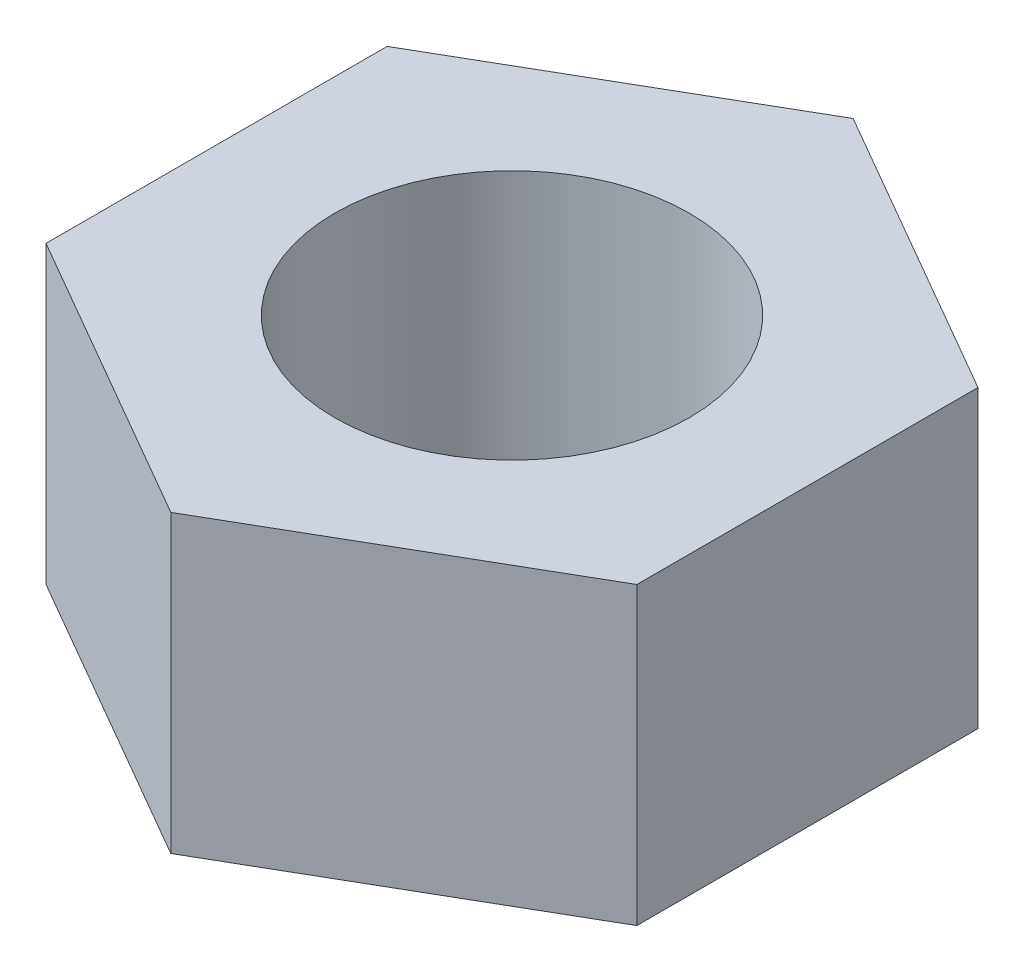
ISO-10303-21;
HEADER;
FILE_DESCRIPTION(('STEP AP214'),'2;1');
FILE_NAME('part.step','',(''),(''),'','','');
FILE_SCHEMA(('AUTOMOTIVE_DESIGN { 1 0 10303 214 1 1 1 1 }'));
ENDSEC;
DATA;
#1=APPLICATION_CONTEXT('core data for automotive mechanical design processes');
#2=APPLICATION_PROTOCOL_DEFINITION('international standard','automotive_design',2000,#1);
#3=PRODUCT_CONTEXT('',#1,'mechanical');
#4=PRODUCT('Part','Part','',(#3));
#5=PRODUCT_RELATED_PRODUCT_CATEGORY('part','',(#4));
#6=PRODUCT_DEFINITION_FORMATION('','',#4);
#7=PRODUCT_DEFINITION_CONTEXT('part definition',#1,'design');
#8=PRODUCT_DEFINITION('design','',#6,#7);
#9=PRODUCT_DEFINITION_SHAPE('','',#8);
#10=(LENGTH_UNIT() NAMED_UNIT(*) SI_UNIT(.MILLI.,.METRE.));
#11=(NAMED_UNIT(*) PLANE_ANGLE_UNIT() SI_UNIT($,.RADIAN.));
#12=(NAMED_UNIT(*) SI_UNIT($,.STERADIAN.) SOLID_ANGLE_UNIT());
#13=UNCERTAINTY_MEASURE_WITH_UNIT(LENGTH_MEASURE(1.E-05),#10,'distance_accuracy_value','');
#14=(GEOMETRIC_REPRESENTATION_CONTEXT(3) GLOBAL_UNCERTAINTY_ASSIGNED_CONTEXT((#13)) GLOBAL_UNIT_ASSIGNED_CONTEXT((#10,
#11,#12)) REPRESENTATION_CONTEXT('',''));
#15=CARTESIAN_POINT('',(0.,0.,0.));
#16=DIRECTION('',(0.,0.,1.));
#17=DIRECTION('',(1.,0.,0.));
#18=AXIS2_PLACEMENT_3D('',#15,#16,#17);
#19=CARTESIAN_POINT('',(0.,5.,0.));
#20=DIRECTION('',(0.,-1.,0.));
#21=DIRECTION('',(0.,0.,-1.));
#22=AXIS2_PLACEMENT_3D('',#19,#20,#21);
#23=PLANE('',#22);
#24=DIRECTION('',(0.866025403784438,0.,-0.500000000000001));
#25=VECTOR('',#24,1.);
#26=CARTESIAN_POINT('',(0.,5.,5.77350269189626));
#27=LINE('',#26,#25);
#28=CARTESIAN_POINT('',(0.,5.,5.77350269189626));
#29=VERTEX_POINT('',#28);
#30=CARTESIAN_POINT('',(5.,5.,2.88675134594812));
#31=VERTEX_POINT('',#30);
#32=EDGE_CURVE('E129',#29,#31,#27,.T.);
#33=ORIENTED_EDGE('',*,*,#32,.T.);
#34=DIRECTION('',(0.,0.,-1.));
#35=VECTOR('',#34,1.);
#36=CARTESIAN_POINT('',(5.,5.,-2.88675134594814));
#37=LINE('',#36,#35);
#38=CARTESIAN_POINT('',(5.,5.,-2.88675134594814));
#39=VERTEX_POINT('',#38);
#40=EDGE_CURVE('E87',#31,#39,#37,.T.);
#41=ORIENTED_EDGE('',*,*,#40,.T.);
#42=DIRECTION('',(-0.866025403784438,0.,-0.500000000000001));
#43=VECTOR('',#42,1.);
#44=CARTESIAN_POINT('',(0.,5.,-5.77350269189627));
#45=LINE('',#44,#43);
#46=CARTESIAN_POINT('',(0.,5.,-5.77350269189627));
#47=VERTEX_POINT('',#46);
#48=EDGE_CURVE('E100',#39,#47,#45,.T.);
#49=ORIENTED_EDGE('',*,*,#48,.T.);
#50=DIRECTION('',(-0.866025403784438,0.,0.5));
#51=VECTOR('',#50,1.);
#52=CARTESIAN_POINT('',(-4.99999999999999,5.,-2.88675134594814));
#53=LINE('',#52,#51);
#54=CARTESIAN_POINT('',(-4.99999999999999,5.,-2.88675134594814));
#55=VERTEX_POINT('',#54);
#56=EDGE_CURVE('E94',#47,#55,#53,.T.);
#57=ORIENTED_EDGE('',*,*,#56,.T.);
#58=DIRECTION('',(0.,0.,1.));
#59=VECTOR('',#58,1.);
#60=CARTESIAN_POINT('',(-4.99999999999999,5.,-2.88675134594814));
#61=LINE('',#60,#59);
#62=CARTESIAN_POINT('',(-5.,5.,2.88675134594812));
#63=VERTEX_POINT('',#62);
#64=EDGE_CURVE('E98',#55,#63,#61,.T.);
#65=ORIENTED_EDGE('',*,*,#64,.T.);
#66=DIRECTION('',(0.866025403784438,0.,0.500000000000001));
#67=VECTOR('',#66,1.);
#68=CARTESIAN_POINT('',(-5.,5.,2.88675134594812));
#69=LINE('',#68,#67);
#70=EDGE_CURVE('E50',#63,#29,#69,.T.);
#71=ORIENTED_EDGE('',*,*,#70,.T.);
#72=EDGE_LOOP('',(#33,#41,#49,#57,#65,#71));
#73=FACE_BOUND('',#72,.T.);
#74=CARTESIAN_POINT('',(0.,5.,0.));
#75=DIRECTION('',(0.,1.,0.));
#76=DIRECTION('',(0.,0.,1.));
#77=AXIS2_PLACEMENT_3D('',#74,#75,#76);
#78=CIRCLE('',#77,3.);
#79=CARTESIAN_POINT('',(0.,5.,3.));
#80=VERTEX_POINT('',#79);
#81=EDGE_CURVE('E122',#80,#80,#78,.T.);
#82=ORIENTED_EDGE('',*,*,#81,.F.);
#83=EDGE_LOOP('',(#82));
#84=FACE_BOUND('',#83,.T.);
#85=ADVANCED_FACE('F33',(#73,#84),#23,.F.);
#86=CARTESIAN_POINT('',(0.,0.,0.));
#87=DIRECTION('',(0.,-1.,0.));
#88=DIRECTION('',(0.,0.,-1.));
#89=AXIS2_PLACEMENT_3D('',#86,#87,#88);
#90=PLANE('',#89);
#91=DIRECTION('',(0.866025403784438,0.,-0.500000000000001));
#92=VECTOR('',#91,1.);
#93=CARTESIAN_POINT('',(0.,0.,5.77350269189626));
#94=LINE('',#93,#92);
#95=CARTESIAN_POINT('',(0.,0.,5.77350269189626));
#96=VERTEX_POINT('',#95);
#97=CARTESIAN_POINT('',(5.,0.,2.88675134594812));
#98=VERTEX_POINT('',#97);
#99=EDGE_CURVE('E118',#96,#98,#94,.T.);
#100=ORIENTED_EDGE('',*,*,#99,.F.);
#101=DIRECTION('',(0.866025403784438,0.,0.500000000000001));
#102=VECTOR('',#101,1.);
#103=CARTESIAN_POINT('',(-5.,0.,2.88675134594812));
#104=LINE('',#103,#102);
#105=CARTESIAN_POINT('',(-5.,0.,2.88675134594812));
#106=VERTEX_POINT('',#105);
#107=EDGE_CURVE('E79',#106,#96,#104,.T.);
#108=ORIENTED_EDGE('',*,*,#107,.F.);
#109=DIRECTION('',(0.,0.,1.));
#110=VECTOR('',#109,1.);
#111=CARTESIAN_POINT('',(-4.99999999999999,0.,-2.88675134594814));
#112=LINE('',#111,#110);
#113=CARTESIAN_POINT('',(-4.99999999999999,0.,-2.88675134594814));
#114=VERTEX_POINT('',#113);
#115=EDGE_CURVE('E73',#114,#106,#112,.T.);
#116=ORIENTED_EDGE('',*,*,#115,.F.);
#117=DIRECTION('',(-0.866025403784438,0.,0.5));
#118=VECTOR('',#117,1.);
#119=CARTESIAN_POINT('',(-4.99999999999999,0.,-2.88675134594814));
#120=LINE('',#119,#118);
#121=CARTESIAN_POINT('',(0.,0.,-5.77350269189627));
#122=VERTEX_POINT('',#121);
#123=EDGE_CURVE('E108',#122,#114,#120,.T.);
#124=ORIENTED_EDGE('',*,*,#123,.F.);
#125=DIRECTION('',(-0.866025403784438,0.,-0.500000000000001));
#126=VECTOR('',#125,1.);
#127=CARTESIAN_POINT('',(0.,0.,-5.77350269189627));
#128=LINE('',#127,#126);
#129=CARTESIAN_POINT('',(5.,0.,-2.88675134594814));
#130=VERTEX_POINT('',#129);
#131=EDGE_CURVE('E124',#130,#122,#128,.T.);
#132=ORIENTED_EDGE('',*,*,#131,.F.);
#133=DIRECTION('',(0.,0.,-1.));
#134=VECTOR('',#133,1.);
#135=CARTESIAN_POINT('',(5.,0.,-2.88675134594814));
#136=LINE('',#135,#134);
#137=EDGE_CURVE('E121',#98,#130,#136,.T.);
#138=ORIENTED_EDGE('',*,*,#137,.F.);
#139=EDGE_LOOP('',(#100,#108,#116,#124,#132,#138));
#140=FACE_BOUND('',#139,.T.);
#141=CARTESIAN_POINT('',(0.,0.,0.));
#142=DIRECTION('',(0.,1.,0.));
#143=DIRECTION('',(0.,0.,1.));
#144=AXIS2_PLACEMENT_3D('',#141,#142,#143);
#145=CIRCLE('',#144,3.);
#146=CARTESIAN_POINT('',(0.,0.,3.));
#147=VERTEX_POINT('',#146);
#148=EDGE_CURVE('E222',#147,#147,#145,.T.);
#149=ORIENTED_EDGE('',*,*,#148,.T.);
#150=EDGE_LOOP('',(#149));
#151=FACE_BOUND('',#150,.T.);
#152=ADVANCED_FACE('F138',(#140,#151),#90,.T.);
#153=CARTESIAN_POINT('',(0.,5.,5.77350269189626));
#154=DIRECTION('',(-0.500000000000001,0.,-0.866025403784438));
#155=DIRECTION('',(-0.866025403784438,0.,0.500000000000001));
#156=AXIS2_PLACEMENT_3D('',#153,#154,#155);
#157=PLANE('',#156);
#158=ORIENTED_EDGE('',*,*,#99,.T.);
#159=DIRECTION('',(0.,-1.,0.));
#160=VECTOR('',#159,1.);
#161=CARTESIAN_POINT('',(5.,5.,2.88675134594812));
#162=LINE('',#161,#160);
#163=EDGE_CURVE('E11',#31,#98,#162,.T.);
#164=ORIENTED_EDGE('',*,*,#163,.F.);
#165=ORIENTED_EDGE('',*,*,#32,.F.);
#166=DIRECTION('',(0.,-1.,0.));
#167=VECTOR('',#166,1.);
#168=CARTESIAN_POINT('',(0.,5.,5.77350269189626));
#169=LINE('',#168,#167);
#170=EDGE_CURVE('E114',#29,#96,#169,.T.);
#171=ORIENTED_EDGE('',*,*,#170,.T.);
#172=EDGE_LOOP('',(#158,#164,#165,#171));
#173=FACE_BOUND('',#172,.T.);
#174=ADVANCED_FACE('F35',(#173),#157,.F.);
#175=CARTESIAN_POINT('',(5.,5.,-2.88675134594814));
#176=DIRECTION('',(-1.,0.,0.));
#177=DIRECTION('',(0.,0.,1.));
#178=AXIS2_PLACEMENT_3D('',#175,#176,#177);
#179=PLANE('',#178);
#180=ORIENTED_EDGE('',*,*,#137,.T.);
#181=DIRECTION('',(0.,-1.,0.));
#182=VECTOR('',#181,1.);
#183=CARTESIAN_POINT('',(5.,5.,-2.88675134594814));
#184=LINE('',#183,#182);
#185=EDGE_CURVE('E42',#39,#130,#184,.T.);
#186=ORIENTED_EDGE('',*,*,#185,.F.);
#187=ORIENTED_EDGE('',*,*,#40,.F.);
#188=ORIENTED_EDGE('',*,*,#163,.T.);
#189=EDGE_LOOP('',(#180,#186,#187,#188));
#190=FACE_BOUND('',#189,.T.);
#191=ADVANCED_FACE('F163',(#190),#179,.F.);
#192=CARTESIAN_POINT('',(0.,5.,-5.77350269189627));
#193=DIRECTION('',(-0.500000000000001,0.,0.866025403784438));
#194=DIRECTION('',(0.866025403784438,0.,0.500000000000001));
#195=AXIS2_PLACEMENT_3D('',#192,#193,#194);
#196=PLANE('',#195);
#197=ORIENTED_EDGE('',*,*,#131,.T.);
#198=DIRECTION('',(0.,-1.,0.));
#199=VECTOR('',#198,1.);
#200=CARTESIAN_POINT('',(0.,5.,-5.77350269189627));
#201=LINE('',#200,#199);
#202=EDGE_CURVE('E109',#47,#122,#201,.T.);
#203=ORIENTED_EDGE('',*,*,#202,.F.);
#204=ORIENTED_EDGE('',*,*,#48,.F.);
#205=ORIENTED_EDGE('',*,*,#185,.T.);
#206=EDGE_LOOP('',(#197,#203,#204,#205));
#207=FACE_BOUND('',#206,.T.);
#208=ADVANCED_FACE('F135',(#207),#196,.F.);
#209=CARTESIAN_POINT('',(-4.99999999999999,5.,-2.88675134594814));
#210=DIRECTION('',(0.5,0.,0.866025403784438));
#211=DIRECTION('',(0.866025403784439,0.,-0.5));
#212=AXIS2_PLACEMENT_3D('',#209,#210,#211);
#213=PLANE('',#212);
#214=ORIENTED_EDGE('',*,*,#123,.T.);
#215=DIRECTION('',(0.,-1.,0.));
#216=VECTOR('',#215,1.);
#217=CARTESIAN_POINT('',(-4.99999999999999,5.,-2.88675134594814));
#218=LINE('',#217,#216);
#219=EDGE_CURVE('E105',#55,#114,#218,.T.);
#220=ORIENTED_EDGE('',*,*,#219,.F.);
#221=ORIENTED_EDGE('',*,*,#56,.F.);
#222=ORIENTED_EDGE('',*,*,#202,.T.);
#223=EDGE_LOOP('',(#214,#220,#221,#222));
#224=FACE_BOUND('',#223,.T.);
#225=ADVANCED_FACE('F106',(#224),#213,.F.);
#226=CARTESIAN_POINT('',(-4.99999999999999,5.,-2.88675134594814));
#227=DIRECTION('',(1.,0.,0.));
#228=DIRECTION('',(0.,0.,-1.));
#229=AXIS2_PLACEMENT_3D('',#226,#227,#228);
#230=PLANE('',#229);
#231=ORIENTED_EDGE('',*,*,#115,.T.);
#232=DIRECTION('',(0.,-1.,0.));
#233=VECTOR('',#232,1.);
#234=CARTESIAN_POINT('',(-5.,5.,2.88675134594812));
#235=LINE('',#234,#233);
#236=EDGE_CURVE('E110',#63,#106,#235,.T.);
#237=ORIENTED_EDGE('',*,*,#236,.F.);
#238=ORIENTED_EDGE('',*,*,#64,.F.);
#239=ORIENTED_EDGE('',*,*,#219,.T.);
#240=EDGE_LOOP('',(#231,#237,#238,#239));
#241=FACE_BOUND('',#240,.T.);
#242=ADVANCED_FACE('F112',(#241),#230,.F.);
#243=CARTESIAN_POINT('',(-5.,5.,2.88675134594812));
#244=DIRECTION('',(0.500000000000001,0.,-0.866025403784438));
#245=DIRECTION('',(-0.866025403784438,0.,-0.500000000000001));
#246=AXIS2_PLACEMENT_3D('',#243,#244,#245);
#247=PLANE('',#246);
#248=ORIENTED_EDGE('',*,*,#107,.T.);
#249=ORIENTED_EDGE('',*,*,#170,.F.);
#250=ORIENTED_EDGE('',*,*,#70,.F.);
#251=ORIENTED_EDGE('',*,*,#236,.T.);
#252=EDGE_LOOP('',(#248,#249,#250,#251));
#253=FACE_BOUND('',#252,.T.);
#254=ADVANCED_FACE('F143',(#253),#247,.F.);
#255=CARTESIAN_POINT('',(0.,5.,0.));
#256=DIRECTION('',(0.,-1.,0.));
#257=DIRECTION('',(0.,0.,-1.));
#258=AXIS2_PLACEMENT_3D('',#255,#256,#257);
#259=CYLINDRICAL_SURFACE('',#258,3.);
#260=ORIENTED_EDGE('',*,*,#81,.T.);
#261=EDGE_LOOP('',(#260));
#262=FACE_BOUND('',#261,.T.);
#263=ORIENTED_EDGE('',*,*,#148,.F.);
#264=EDGE_LOOP('',(#263));
#265=FACE_BOUND('',#264,.T.);
#266=ADVANCED_FACE('F145',(#262,#265),#259,.F.);
#267=CLOSED_SHELL('',(#85,#152,#174,#191,#208,#225,#242,#254,#266));
#268=MANIFOLD_SOLID_BREP('B2',#267);
#269=ADVANCED_BREP_SHAPE_REPRESENTATION('',(#18,#268),#14);
#270=SHAPE_DEFINITION_REPRESENTATION(#9,#269);
ENDSEC;
END-ISO-10303-21;
